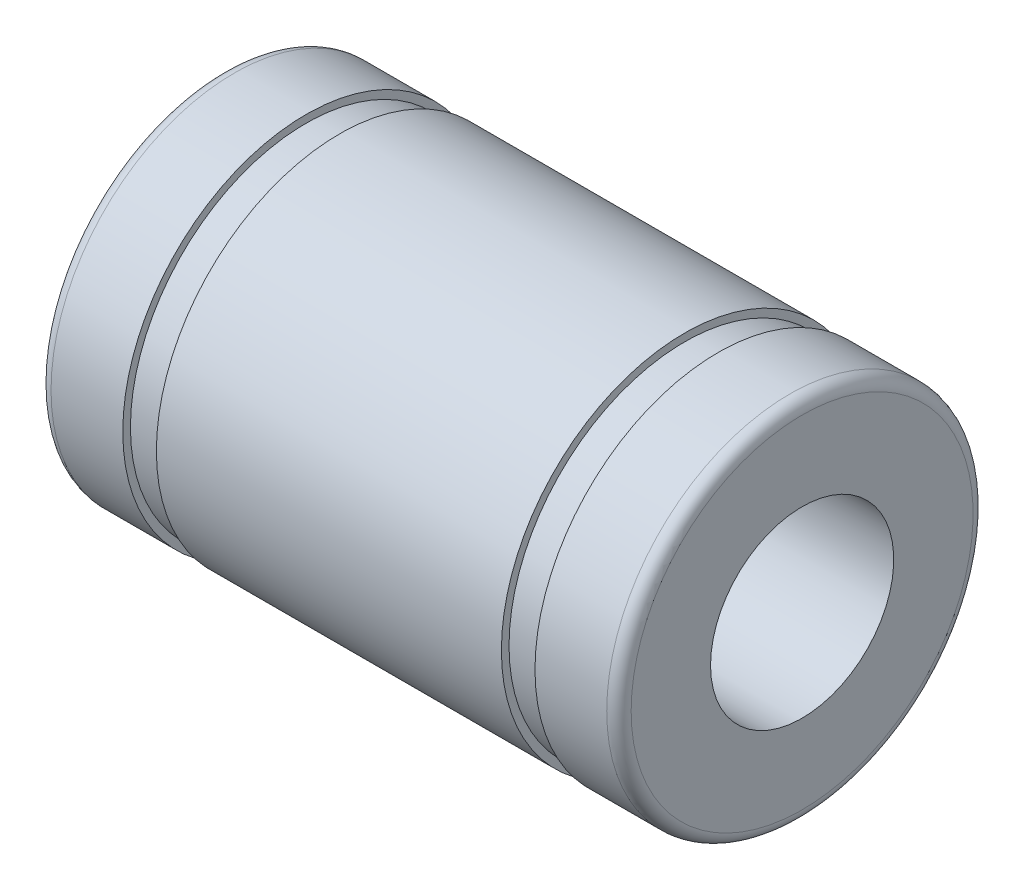
ISO-10303-21;
HEADER;
FILE_DESCRIPTION(('STEP AP214'),'2;1');
FILE_NAME('part.step','',(''),(''),'','','');
FILE_SCHEMA(('AUTOMOTIVE_DESIGN { 1 0 10303 214 1 1 1 1 }'));
ENDSEC;
DATA;
#1=APPLICATION_CONTEXT('core data for automotive mechanical design processes');
#2=APPLICATION_PROTOCOL_DEFINITION('international standard','automotive_design',2000,#1);
#3=PRODUCT_CONTEXT('',#1,'mechanical');
#4=PRODUCT('Part','Part','',(#3));
#5=PRODUCT_RELATED_PRODUCT_CATEGORY('part','',(#4));
#6=PRODUCT_DEFINITION_FORMATION('','',#4);
#7=PRODUCT_DEFINITION_CONTEXT('part definition',#1,'design');
#8=PRODUCT_DEFINITION('design','',#6,#7);
#9=PRODUCT_DEFINITION_SHAPE('','',#8);
#10=(LENGTH_UNIT() NAMED_UNIT(*) SI_UNIT(.MILLI.,.METRE.));
#11=(NAMED_UNIT(*) PLANE_ANGLE_UNIT() SI_UNIT($,.RADIAN.));
#12=(NAMED_UNIT(*) SI_UNIT($,.STERADIAN.) SOLID_ANGLE_UNIT());
#13=UNCERTAINTY_MEASURE_WITH_UNIT(LENGTH_MEASURE(1.E-05),#10,'distance_accuracy_value','');
#14=(GEOMETRIC_REPRESENTATION_CONTEXT(3) GLOBAL_UNCERTAINTY_ASSIGNED_CONTEXT((#13)) GLOBAL_UNIT_ASSIGNED_CONTEXT((#10,
#11,#12)) REPRESENTATION_CONTEXT('',''));
#15=CARTESIAN_POINT('',(0.,0.,0.));
#16=DIRECTION('',(0.,0.,1.));
#17=DIRECTION('',(1.,0.,0.));
#18=AXIS2_PLACEMENT_3D('',#15,#16,#17);
#19=CARTESIAN_POINT('',(0.399999999999999,0.,0.));
#20=DIRECTION('',(-1.,0.,0.));
#21=DIRECTION('',(0.,0.,1.));
#22=AXIS2_PLACEMENT_3D('',#19,#20,#21);
#23=TOROIDAL_SURFACE('',#22,5.6,0.399999999999999);
#24=CARTESIAN_POINT('',(0.,0.,0.));
#25=DIRECTION('',(-1.,0.,0.));
#26=DIRECTION('',(0.,0.,1.));
#27=AXIS2_PLACEMENT_3D('',#24,#25,#26);
#28=CIRCLE('',#27,5.6);
#29=CARTESIAN_POINT('',(0.,0.,5.6));
#30=VERTEX_POINT('',#29);
#31=EDGE_CURVE('E10',#30,#30,#28,.T.);
#32=ORIENTED_EDGE('',*,*,#31,.F.);
#33=EDGE_LOOP('',(#32));
#34=FACE_BOUND('',#33,.T.);
#35=CARTESIAN_POINT('',(0.400000000000001,0.,0.));
#36=DIRECTION('',(-1.,0.,0.));
#37=DIRECTION('',(0.,0.,1.));
#38=AXIS2_PLACEMENT_3D('',#35,#36,#37);
#39=CIRCLE('',#38,6.);
#40=CARTESIAN_POINT('',(0.400000000000001,0.,6.));
#41=VERTEX_POINT('',#40);
#42=EDGE_CURVE('E80',#41,#41,#39,.T.);
#43=ORIENTED_EDGE('',*,*,#42,.T.);
#44=EDGE_LOOP('',(#43));
#45=FACE_BOUND('',#44,.T.);
#46=ADVANCED_FACE('F34',(#34,#45),#23,.T.);
#47=CARTESIAN_POINT('',(0.,5.6,0.));
#48=DIRECTION('',(1.,0.,0.));
#49=DIRECTION('',(0.,0.,-1.));
#50=AXIS2_PLACEMENT_3D('',#47,#48,#49);
#51=PLANE('',#50);
#52=CARTESIAN_POINT('',(0.,0.,0.));
#53=DIRECTION('',(-1.,0.,0.));
#54=DIRECTION('',(0.,0.,1.));
#55=AXIS2_PLACEMENT_3D('',#52,#53,#54);
#56=CIRCLE('',#55,3.);
#57=CARTESIAN_POINT('',(0.,0.,3.));
#58=VERTEX_POINT('',#57);
#59=EDGE_CURVE('E40',#58,#58,#56,.T.);
#60=ORIENTED_EDGE('',*,*,#59,.F.);
#61=EDGE_LOOP('',(#60));
#62=FACE_BOUND('',#61,.T.);
#63=ORIENTED_EDGE('',*,*,#31,.T.);
#64=EDGE_LOOP('',(#63));
#65=FACE_BOUND('',#64,.T.);
#66=ADVANCED_FACE('F153',(#62,#65),#51,.F.);
#67=CARTESIAN_POINT('',(19.,0.,0.));
#68=DIRECTION('',(-1.,0.,0.));
#69=DIRECTION('',(0.,0.,1.));
#70=AXIS2_PLACEMENT_3D('',#67,#68,#69);
#71=CYLINDRICAL_SURFACE('',#70,3.);
#72=CARTESIAN_POINT('',(19.,0.,0.));
#73=DIRECTION('',(-1.,0.,0.));
#74=DIRECTION('',(0.,0.,1.));
#75=AXIS2_PLACEMENT_3D('',#72,#73,#74);
#76=CIRCLE('',#75,3.);
#77=CARTESIAN_POINT('',(19.,0.,3.));
#78=VERTEX_POINT('',#77);
#79=EDGE_CURVE('E44',#78,#78,#76,.T.);
#80=ORIENTED_EDGE('',*,*,#79,.F.);
#81=EDGE_LOOP('',(#80));
#82=FACE_BOUND('',#81,.T.);
#83=ORIENTED_EDGE('',*,*,#59,.T.);
#84=EDGE_LOOP('',(#83));
#85=FACE_BOUND('',#84,.T.);
#86=ADVANCED_FACE('F148',(#82,#85),#71,.F.);
#87=CARTESIAN_POINT('',(19.,3.,0.));
#88=DIRECTION('',(-1.,0.,0.));
#89=DIRECTION('',(0.,0.,1.));
#90=AXIS2_PLACEMENT_3D('',#87,#88,#89);
#91=PLANE('',#90);
#92=CARTESIAN_POINT('',(19.,0.,0.));
#93=DIRECTION('',(-1.,0.,0.));
#94=DIRECTION('',(0.,0.,1.));
#95=AXIS2_PLACEMENT_3D('',#92,#93,#94);
#96=CIRCLE('',#95,5.6);
#97=CARTESIAN_POINT('',(19.,0.,5.6));
#98=VERTEX_POINT('',#97);
#99=EDGE_CURVE('E48',#98,#98,#96,.T.);
#100=ORIENTED_EDGE('',*,*,#99,.F.);
#101=EDGE_LOOP('',(#100));
#102=FACE_BOUND('',#101,.T.);
#103=ORIENTED_EDGE('',*,*,#79,.T.);
#104=EDGE_LOOP('',(#103));
#105=FACE_BOUND('',#104,.T.);
#106=ADVANCED_FACE('F142',(#102,#105),#91,.F.);
#107=CARTESIAN_POINT('',(18.6,0.,0.));
#108=DIRECTION('',(-1.,0.,0.));
#109=DIRECTION('',(0.,0.,1.));
#110=AXIS2_PLACEMENT_3D('',#107,#108,#109);
#111=TOROIDAL_SURFACE('',#110,5.6,0.399999999999998);
#112=CARTESIAN_POINT('',(18.6,0.,0.));
#113=DIRECTION('',(-1.,0.,0.));
#114=DIRECTION('',(0.,0.,1.));
#115=AXIS2_PLACEMENT_3D('',#112,#113,#114);
#116=CIRCLE('',#115,6.);
#117=CARTESIAN_POINT('',(18.6,0.,6.));
#118=VERTEX_POINT('',#117);
#119=EDGE_CURVE('E53',#118,#118,#116,.T.);
#120=ORIENTED_EDGE('',*,*,#119,.F.);
#121=EDGE_LOOP('',(#120));
#122=FACE_BOUND('',#121,.T.);
#123=ORIENTED_EDGE('',*,*,#99,.T.);
#124=EDGE_LOOP('',(#123));
#125=FACE_BOUND('',#124,.T.);
#126=ADVANCED_FACE('F136',(#122,#125),#111,.T.);
#127=CARTESIAN_POINT('',(19.,0.,0.));
#128=DIRECTION('',(-1.,0.,0.));
#129=DIRECTION('',(0.,0.,1.));
#130=AXIS2_PLACEMENT_3D('',#127,#128,#129);
#131=CYLINDRICAL_SURFACE('',#130,6.);
#132=CARTESIAN_POINT('',(16.25,0.,0.));
#133=DIRECTION('',(-1.,0.,0.));
#134=DIRECTION('',(0.,0.,1.));
#135=AXIS2_PLACEMENT_3D('',#132,#133,#134);
#136=CIRCLE('',#135,6.);
#137=CARTESIAN_POINT('',(16.25,0.,6.));
#138=VERTEX_POINT('',#137);
#139=EDGE_CURVE('E56',#138,#138,#136,.T.);
#140=ORIENTED_EDGE('',*,*,#139,.F.);
#141=EDGE_LOOP('',(#140));
#142=FACE_BOUND('',#141,.T.);
#143=ORIENTED_EDGE('',*,*,#119,.T.);
#144=EDGE_LOOP('',(#143));
#145=FACE_BOUND('',#144,.T.);
#146=ADVANCED_FACE('F130',(#142,#145),#131,.T.);
#147=CARTESIAN_POINT('',(16.25,6.,0.));
#148=DIRECTION('',(1.,0.,0.));
#149=DIRECTION('',(0.,0.,-1.));
#150=AXIS2_PLACEMENT_3D('',#147,#148,#149);
#151=PLANE('',#150);
#152=CARTESIAN_POINT('',(16.25,0.,0.));
#153=DIRECTION('',(-1.,0.,0.));
#154=DIRECTION('',(0.,0.,1.));
#155=AXIS2_PLACEMENT_3D('',#152,#153,#154);
#156=CIRCLE('',#155,5.75);
#157=CARTESIAN_POINT('',(16.25,0.,5.75));
#158=VERTEX_POINT('',#157);
#159=EDGE_CURVE('E59',#158,#158,#156,.T.);
#160=ORIENTED_EDGE('',*,*,#159,.F.);
#161=EDGE_LOOP('',(#160));
#162=FACE_BOUND('',#161,.T.);
#163=ORIENTED_EDGE('',*,*,#139,.T.);
#164=EDGE_LOOP('',(#163));
#165=FACE_BOUND('',#164,.T.);
#166=ADVANCED_FACE('F124',(#162,#165),#151,.F.);
#167=CARTESIAN_POINT('',(19.,0.,0.));
#168=DIRECTION('',(-1.,0.,0.));
#169=DIRECTION('',(0.,0.,1.));
#170=AXIS2_PLACEMENT_3D('',#167,#168,#169);
#171=CYLINDRICAL_SURFACE('',#170,5.75);
#172=CARTESIAN_POINT('',(15.15,0.,0.));
#173=DIRECTION('',(-1.,0.,0.));
#174=DIRECTION('',(0.,0.,1.));
#175=AXIS2_PLACEMENT_3D('',#172,#173,#174);
#176=CIRCLE('',#175,5.75);
#177=CARTESIAN_POINT('',(15.15,0.,5.75));
#178=VERTEX_POINT('',#177);
#179=EDGE_CURVE('E62',#178,#178,#176,.T.);
#180=ORIENTED_EDGE('',*,*,#179,.F.);
#181=EDGE_LOOP('',(#180));
#182=FACE_BOUND('',#181,.T.);
#183=ORIENTED_EDGE('',*,*,#159,.T.);
#184=EDGE_LOOP('',(#183));
#185=FACE_BOUND('',#184,.T.);
#186=ADVANCED_FACE('F118',(#182,#185),#171,.T.);
#187=CARTESIAN_POINT('',(15.15,5.75,0.));
#188=DIRECTION('',(-1.,0.,0.));
#189=DIRECTION('',(0.,0.,1.));
#190=AXIS2_PLACEMENT_3D('',#187,#188,#189);
#191=PLANE('',#190);
#192=CARTESIAN_POINT('',(15.15,0.,0.));
#193=DIRECTION('',(-1.,0.,0.));
#194=DIRECTION('',(0.,0.,1.));
#195=AXIS2_PLACEMENT_3D('',#192,#193,#194);
#196=CIRCLE('',#195,6.);
#197=CARTESIAN_POINT('',(15.15,0.,6.));
#198=VERTEX_POINT('',#197);
#199=EDGE_CURVE('E65',#198,#198,#196,.T.);
#200=ORIENTED_EDGE('',*,*,#199,.F.);
#201=EDGE_LOOP('',(#200));
#202=FACE_BOUND('',#201,.T.);
#203=ORIENTED_EDGE('',*,*,#179,.T.);
#204=EDGE_LOOP('',(#203));
#205=FACE_BOUND('',#204,.T.);
#206=ADVANCED_FACE('F112',(#202,#205),#191,.F.);
#207=CARTESIAN_POINT('',(19.,0.,0.));
#208=DIRECTION('',(-1.,0.,0.));
#209=DIRECTION('',(0.,0.,1.));
#210=AXIS2_PLACEMENT_3D('',#207,#208,#209);
#211=CYLINDRICAL_SURFACE('',#210,6.);
#212=CARTESIAN_POINT('',(3.85,0.,0.));
#213=DIRECTION('',(-1.,0.,0.));
#214=DIRECTION('',(0.,0.,1.));
#215=AXIS2_PLACEMENT_3D('',#212,#213,#214);
#216=CIRCLE('',#215,6.);
#217=CARTESIAN_POINT('',(3.85,0.,6.));
#218=VERTEX_POINT('',#217);
#219=EDGE_CURVE('E68',#218,#218,#216,.T.);
#220=ORIENTED_EDGE('',*,*,#219,.F.);
#221=EDGE_LOOP('',(#220));
#222=FACE_BOUND('',#221,.T.);
#223=ORIENTED_EDGE('',*,*,#199,.T.);
#224=EDGE_LOOP('',(#223));
#225=FACE_BOUND('',#224,.T.);
#226=ADVANCED_FACE('F106',(#222,#225),#211,.T.);
#227=CARTESIAN_POINT('',(3.85,6.,0.));
#228=DIRECTION('',(1.,0.,0.));
#229=DIRECTION('',(0.,0.,-1.));
#230=AXIS2_PLACEMENT_3D('',#227,#228,#229);
#231=PLANE('',#230);
#232=CARTESIAN_POINT('',(3.85,0.,0.));
#233=DIRECTION('',(-1.,0.,0.));
#234=DIRECTION('',(0.,0.,1.));
#235=AXIS2_PLACEMENT_3D('',#232,#233,#234);
#236=CIRCLE('',#235,5.75);
#237=CARTESIAN_POINT('',(3.85,0.,5.75));
#238=VERTEX_POINT('',#237);
#239=EDGE_CURVE('E71',#238,#238,#236,.T.);
#240=ORIENTED_EDGE('',*,*,#239,.F.);
#241=EDGE_LOOP('',(#240));
#242=FACE_BOUND('',#241,.T.);
#243=ORIENTED_EDGE('',*,*,#219,.T.);
#244=EDGE_LOOP('',(#243));
#245=FACE_BOUND('',#244,.T.);
#246=ADVANCED_FACE('F100',(#242,#245),#231,.F.);
#247=CARTESIAN_POINT('',(19.,0.,0.));
#248=DIRECTION('',(-1.,0.,0.));
#249=DIRECTION('',(0.,0.,1.));
#250=AXIS2_PLACEMENT_3D('',#247,#248,#249);
#251=CYLINDRICAL_SURFACE('',#250,5.75);
#252=CARTESIAN_POINT('',(2.75,0.,0.));
#253=DIRECTION('',(-1.,0.,0.));
#254=DIRECTION('',(0.,0.,1.));
#255=AXIS2_PLACEMENT_3D('',#252,#253,#254);
#256=CIRCLE('',#255,5.75);
#257=CARTESIAN_POINT('',(2.75,0.,5.75));
#258=VERTEX_POINT('',#257);
#259=EDGE_CURVE('E74',#258,#258,#256,.T.);
#260=ORIENTED_EDGE('',*,*,#259,.F.);
#261=EDGE_LOOP('',(#260));
#262=FACE_BOUND('',#261,.T.);
#263=ORIENTED_EDGE('',*,*,#239,.T.);
#264=EDGE_LOOP('',(#263));
#265=FACE_BOUND('',#264,.T.);
#266=ADVANCED_FACE('F94',(#262,#265),#251,.T.);
#267=CARTESIAN_POINT('',(2.75,5.75,0.));
#268=DIRECTION('',(-1.,0.,0.));
#269=DIRECTION('',(0.,0.,1.));
#270=AXIS2_PLACEMENT_3D('',#267,#268,#269);
#271=PLANE('',#270);
#272=CARTESIAN_POINT('',(2.75,0.,0.));
#273=DIRECTION('',(-1.,0.,0.));
#274=DIRECTION('',(0.,0.,1.));
#275=AXIS2_PLACEMENT_3D('',#272,#273,#274);
#276=CIRCLE('',#275,6.);
#277=CARTESIAN_POINT('',(2.75,0.,6.));
#278=VERTEX_POINT('',#277);
#279=EDGE_CURVE('E77',#278,#278,#276,.T.);
#280=ORIENTED_EDGE('',*,*,#279,.F.);
#281=EDGE_LOOP('',(#280));
#282=FACE_BOUND('',#281,.T.);
#283=ORIENTED_EDGE('',*,*,#259,.T.);
#284=EDGE_LOOP('',(#283));
#285=FACE_BOUND('',#284,.T.);
#286=ADVANCED_FACE('F88',(#282,#285),#271,.F.);
#287=CARTESIAN_POINT('',(19.,0.,0.));
#288=DIRECTION('',(-1.,0.,0.));
#289=DIRECTION('',(0.,0.,1.));
#290=AXIS2_PLACEMENT_3D('',#287,#288,#289);
#291=CYLINDRICAL_SURFACE('',#290,6.);
#292=ORIENTED_EDGE('',*,*,#42,.F.);
#293=EDGE_LOOP('',(#292));
#294=FACE_BOUND('',#293,.T.);
#295=ORIENTED_EDGE('',*,*,#279,.T.);
#296=EDGE_LOOP('',(#295));
#297=FACE_BOUND('',#296,.T.);
#298=ADVANCED_FACE('F85',(#294,#297),#291,.T.);
#299=CLOSED_SHELL('',(#46,#66,#86,#106,#126,#146,#166,#186,#206,#226,#246,#266,#286,#298));
#300=MANIFOLD_SOLID_BREP('B2',#299);
#301=ADVANCED_BREP_SHAPE_REPRESENTATION('',(#18,#300),#14);
#302=SHAPE_DEFINITION_REPRESENTATION(#9,#301);
ENDSEC;
END-ISO-10303-21;
